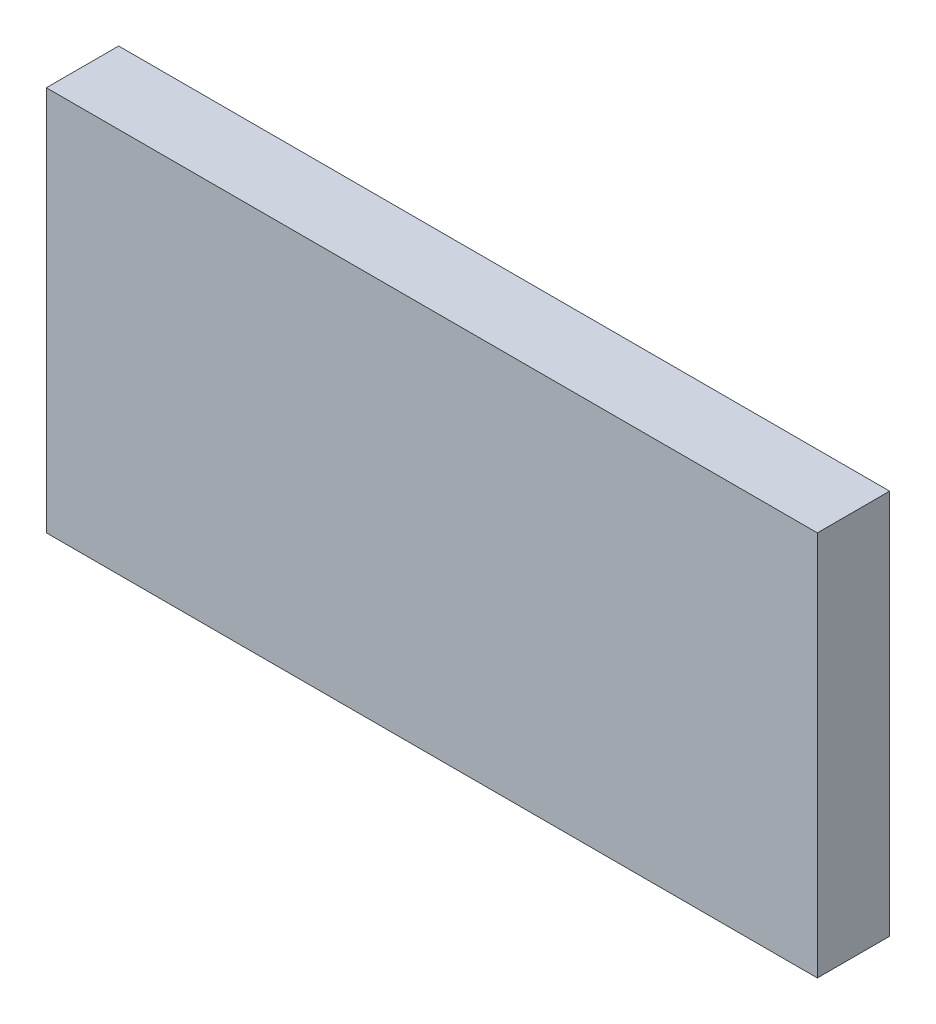
ISO-10303-21;
HEADER;
FILE_DESCRIPTION(('STEP AP214'),'2;1');
FILE_NAME('part.step','',(''),(''),'','','');
FILE_SCHEMA(('AUTOMOTIVE_DESIGN { 1 0 10303 214 1 1 1 1 }'));
ENDSEC;
DATA;
#1=APPLICATION_CONTEXT('core data for automotive mechanical design processes');
#2=APPLICATION_PROTOCOL_DEFINITION('international standard','automotive_design',2000,#1);
#3=PRODUCT_CONTEXT('',#1,'mechanical');
#4=PRODUCT('Part','Part','',(#3));
#5=PRODUCT_RELATED_PRODUCT_CATEGORY('part','',(#4));
#6=PRODUCT_DEFINITION_FORMATION('','',#4);
#7=PRODUCT_DEFINITION_CONTEXT('part definition',#1,'design');
#8=PRODUCT_DEFINITION('design','',#6,#7);
#9=PRODUCT_DEFINITION_SHAPE('','',#8);
#10=(LENGTH_UNIT() NAMED_UNIT(*) SI_UNIT(.MILLI.,.METRE.));
#11=(NAMED_UNIT(*) PLANE_ANGLE_UNIT() SI_UNIT($,.RADIAN.));
#12=(NAMED_UNIT(*) SI_UNIT($,.STERADIAN.) SOLID_ANGLE_UNIT());
#13=UNCERTAINTY_MEASURE_WITH_UNIT(LENGTH_MEASURE(1.E-05),#10,'distance_accuracy_value','');
#14=(GEOMETRIC_REPRESENTATION_CONTEXT(3) GLOBAL_UNCERTAINTY_ASSIGNED_CONTEXT((#13)) GLOBAL_UNIT_ASSIGNED_CONTEXT((#10,
#11,#12)) REPRESENTATION_CONTEXT('',''));
#15=CARTESIAN_POINT('',(0.,0.,0.));
#16=DIRECTION('',(0.,0.,1.));
#17=DIRECTION('',(1.,0.,0.));
#18=AXIS2_PLACEMENT_3D('',#15,#16,#17);
#19=CARTESIAN_POINT('',(0.,0.,0.75));
#20=DIRECTION('',(1.,0.,0.));
#21=DIRECTION('',(0.,1.,0.));
#22=AXIS2_PLACEMENT_3D('',#19,#20,#21);
#23=PLANE('',#22);
#24=DIRECTION('',(0.,-1.,0.));
#25=VECTOR('',#24,1.);
#26=CARTESIAN_POINT('',(0.,0.,0.));
#27=LINE('',#26,#25);
#28=CARTESIAN_POINT('',(0.,4.,0.));
#29=VERTEX_POINT('',#28);
#30=CARTESIAN_POINT('',(0.,0.,0.));
#31=VERTEX_POINT('',#30);
#32=EDGE_CURVE('E97',#29,#31,#27,.T.);
#33=ORIENTED_EDGE('',*,*,#32,.T.);
#34=DIRECTION('',(0.,0.,-1.));
#35=VECTOR('',#34,1.);
#36=CARTESIAN_POINT('',(0.,0.,0.75));
#37=LINE('',#36,#35);
#38=CARTESIAN_POINT('',(0.,0.,0.75));
#39=VERTEX_POINT('',#38);
#40=EDGE_CURVE('E11',#39,#31,#37,.T.);
#41=ORIENTED_EDGE('',*,*,#40,.F.);
#42=DIRECTION('',(0.,-1.,0.));
#43=VECTOR('',#42,1.);
#44=CARTESIAN_POINT('',(0.,0.,0.75));
#45=LINE('',#44,#43);
#46=CARTESIAN_POINT('',(0.,4.,0.75));
#47=VERTEX_POINT('',#46);
#48=EDGE_CURVE('E85',#47,#39,#45,.T.);
#49=ORIENTED_EDGE('',*,*,#48,.F.);
#50=DIRECTION('',(0.,0.,-1.));
#51=VECTOR('',#50,1.);
#52=CARTESIAN_POINT('',(0.,4.,0.75));
#53=LINE('',#52,#51);
#54=EDGE_CURVE('E93',#47,#29,#53,.T.);
#55=ORIENTED_EDGE('',*,*,#54,.T.);
#56=EDGE_LOOP('',(#33,#41,#49,#55));
#57=FACE_BOUND('',#56,.T.);
#58=ADVANCED_FACE('F34',(#57),#23,.F.);
#59=CARTESIAN_POINT('',(0.,0.,0.75));
#60=DIRECTION('',(0.,1.,0.));
#61=DIRECTION('',(0.,0.,1.));
#62=AXIS2_PLACEMENT_3D('',#59,#60,#61);
#63=PLANE('',#62);
#64=DIRECTION('',(1.,0.,0.));
#65=VECTOR('',#64,1.);
#66=CARTESIAN_POINT('',(0.,0.,0.));
#67=LINE('',#66,#65);
#68=CARTESIAN_POINT('',(8.,0.,0.));
#69=VERTEX_POINT('',#68);
#70=EDGE_CURVE('E89',#31,#69,#67,.T.);
#71=ORIENTED_EDGE('',*,*,#70,.T.);
#72=DIRECTION('',(0.,0.,-1.));
#73=VECTOR('',#72,1.);
#74=CARTESIAN_POINT('',(8.,0.,0.75));
#75=LINE('',#74,#73);
#76=CARTESIAN_POINT('',(8.,0.,0.75));
#77=VERTEX_POINT('',#76);
#78=EDGE_CURVE('E42',#77,#69,#75,.T.);
#79=ORIENTED_EDGE('',*,*,#78,.F.);
#80=DIRECTION('',(1.,0.,0.));
#81=VECTOR('',#80,1.);
#82=CARTESIAN_POINT('',(0.,0.,0.75));
#83=LINE('',#82,#81);
#84=EDGE_CURVE('E80',#39,#77,#83,.T.);
#85=ORIENTED_EDGE('',*,*,#84,.F.);
#86=ORIENTED_EDGE('',*,*,#40,.T.);
#87=EDGE_LOOP('',(#71,#79,#85,#86));
#88=FACE_BOUND('',#87,.T.);
#89=ADVANCED_FACE('F88',(#88),#63,.F.);
#90=CARTESIAN_POINT('',(8.,0.,0.75));
#91=DIRECTION('',(-1.,0.,0.));
#92=DIRECTION('',(0.,-1.,0.));
#93=AXIS2_PLACEMENT_3D('',#90,#91,#92);
#94=PLANE('',#93);
#95=DIRECTION('',(0.,1.,0.));
#96=VECTOR('',#95,1.);
#97=CARTESIAN_POINT('',(8.,0.,0.));
#98=LINE('',#97,#96);
#99=CARTESIAN_POINT('',(8.,4.,0.));
#100=VERTEX_POINT('',#99);
#101=EDGE_CURVE('E67',#69,#100,#98,.T.);
#102=ORIENTED_EDGE('',*,*,#101,.T.);
#103=DIRECTION('',(0.,0.,-1.));
#104=VECTOR('',#103,1.);
#105=CARTESIAN_POINT('',(8.,4.,0.75));
#106=LINE('',#105,#104);
#107=CARTESIAN_POINT('',(8.,4.,0.75));
#108=VERTEX_POINT('',#107);
#109=EDGE_CURVE('E90',#108,#100,#106,.T.);
#110=ORIENTED_EDGE('',*,*,#109,.F.);
#111=DIRECTION('',(0.,1.,0.));
#112=VECTOR('',#111,1.);
#113=CARTESIAN_POINT('',(8.,0.,0.75));
#114=LINE('',#113,#112);
#115=EDGE_CURVE('E83',#77,#108,#114,.T.);
#116=ORIENTED_EDGE('',*,*,#115,.F.);
#117=ORIENTED_EDGE('',*,*,#78,.T.);
#118=EDGE_LOOP('',(#102,#110,#116,#117));
#119=FACE_BOUND('',#118,.T.);
#120=ADVANCED_FACE('F91',(#119),#94,.F.);
#121=CARTESIAN_POINT('',(0.,4.,0.75));
#122=DIRECTION('',(0.,-1.,0.));
#123=DIRECTION('',(0.,0.,-1.));
#124=AXIS2_PLACEMENT_3D('',#121,#122,#123);
#125=PLANE('',#124);
#126=DIRECTION('',(-1.,0.,0.));
#127=VECTOR('',#126,1.);
#128=CARTESIAN_POINT('',(0.,4.,0.));
#129=LINE('',#128,#127);
#130=EDGE_CURVE('E73',#100,#29,#129,.T.);
#131=ORIENTED_EDGE('',*,*,#130,.T.);
#132=ORIENTED_EDGE('',*,*,#54,.F.);
#133=DIRECTION('',(-1.,0.,0.));
#134=VECTOR('',#133,1.);
#135=CARTESIAN_POINT('',(0.,4.,0.75));
#136=LINE('',#135,#134);
#137=EDGE_CURVE('E50',#108,#47,#136,.T.);
#138=ORIENTED_EDGE('',*,*,#137,.F.);
#139=ORIENTED_EDGE('',*,*,#109,.T.);
#140=EDGE_LOOP('',(#131,#132,#138,#139));
#141=FACE_BOUND('',#140,.T.);
#142=ADVANCED_FACE('F104',(#141),#125,.F.);
#143=CARTESIAN_POINT('',(0.,4.,0.75));
#144=DIRECTION('',(0.,0.,-1.));
#145=DIRECTION('',(-1.,0.,0.));
#146=AXIS2_PLACEMENT_3D('',#143,#144,#145);
#147=PLANE('',#146);
#148=ORIENTED_EDGE('',*,*,#48,.T.);
#149=ORIENTED_EDGE('',*,*,#84,.T.);
#150=ORIENTED_EDGE('',*,*,#115,.T.);
#151=ORIENTED_EDGE('',*,*,#137,.T.);
#152=EDGE_LOOP('',(#148,#149,#150,#151));
#153=FACE_BOUND('',#152,.T.);
#154=ADVANCED_FACE('F81',(#153),#147,.F.);
#155=CARTESIAN_POINT('',(0.,4.,0.));
#156=DIRECTION('',(0.,0.,-1.));
#157=DIRECTION('',(-1.,0.,0.));
#158=AXIS2_PLACEMENT_3D('',#155,#156,#157);
#159=PLANE('',#158);
#160=ORIENTED_EDGE('',*,*,#32,.F.);
#161=ORIENTED_EDGE('',*,*,#130,.F.);
#162=ORIENTED_EDGE('',*,*,#101,.F.);
#163=ORIENTED_EDGE('',*,*,#70,.F.);
#164=EDGE_LOOP('',(#160,#161,#162,#163));
#165=FACE_BOUND('',#164,.T.);
#166=ADVANCED_FACE('F107',(#165),#159,.T.);
#167=CLOSED_SHELL('',(#58,#89,#120,#142,#154,#166));
#168=MANIFOLD_SOLID_BREP('B2',#167);
#169=ADVANCED_BREP_SHAPE_REPRESENTATION('',(#18,#168),#14);
#170=SHAPE_DEFINITION_REPRESENTATION(#9,#169);
ENDSEC;
END-ISO-10303-21;
